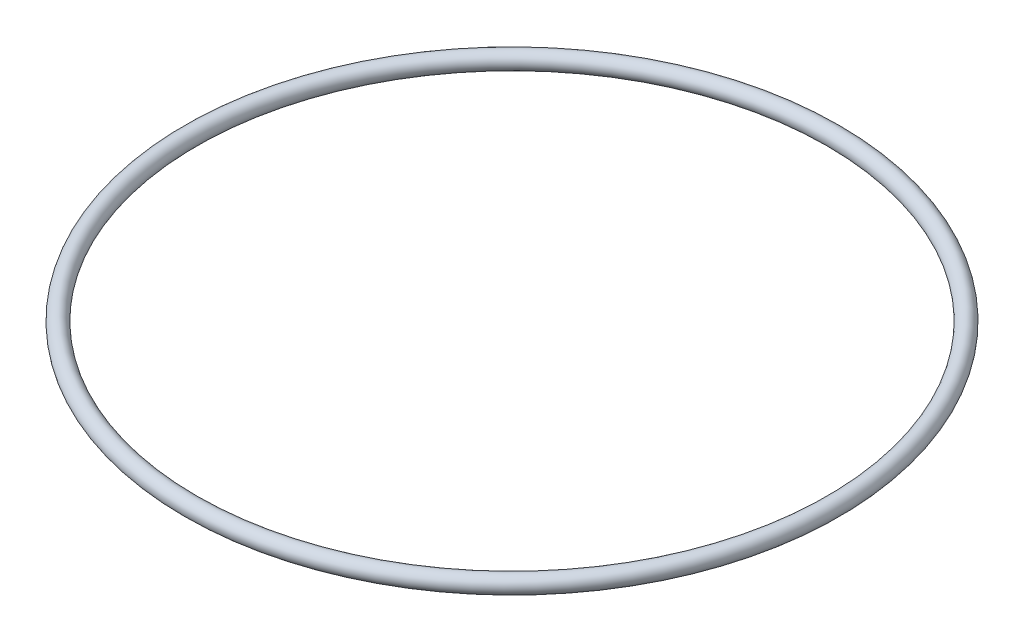
ISO-10303-21;
HEADER;
FILE_DESCRIPTION(('STEP AP214'),'2;1');
FILE_NAME('part.step','',(''),(''),'','','');
FILE_SCHEMA(('AUTOMOTIVE_DESIGN { 1 0 10303 214 1 1 1 1 }'));
ENDSEC;
DATA;
#1=APPLICATION_CONTEXT('core data for automotive mechanical design processes');
#2=APPLICATION_PROTOCOL_DEFINITION('international standard','automotive_design',2000,#1);
#3=PRODUCT_CONTEXT('',#1,'mechanical');
#4=PRODUCT('Part','Part','',(#3));
#5=PRODUCT_RELATED_PRODUCT_CATEGORY('part','',(#4));
#6=PRODUCT_DEFINITION_FORMATION('','',#4);
#7=PRODUCT_DEFINITION_CONTEXT('part definition',#1,'design');
#8=PRODUCT_DEFINITION('design','',#6,#7);
#9=PRODUCT_DEFINITION_SHAPE('','',#8);
#10=(LENGTH_UNIT() NAMED_UNIT(*) SI_UNIT(.MILLI.,.METRE.));
#11=(NAMED_UNIT(*) PLANE_ANGLE_UNIT() SI_UNIT($,.RADIAN.));
#12=(NAMED_UNIT(*) SI_UNIT($,.STERADIAN.) SOLID_ANGLE_UNIT());
#13=UNCERTAINTY_MEASURE_WITH_UNIT(LENGTH_MEASURE(1.E-05),#10,'distance_accuracy_value','');
#14=(GEOMETRIC_REPRESENTATION_CONTEXT(3) GLOBAL_UNCERTAINTY_ASSIGNED_CONTEXT((#13)) GLOBAL_UNIT_ASSIGNED_CONTEXT((#10,
#11,#12)) REPRESENTATION_CONTEXT('',''));
#15=CARTESIAN_POINT('',(0.,0.,0.));
#16=DIRECTION('',(0.,0.,1.));
#17=DIRECTION('',(1.,0.,0.));
#18=AXIS2_PLACEMENT_3D('',#15,#16,#17);
#19=CARTESIAN_POINT('',(0.,0.,0.));
#20=DIRECTION('',(0.,-1.,0.));
#21=DIRECTION('',(0.,0.,-1.));
#22=AXIS2_PLACEMENT_3D('',#19,#20,#21);
#23=TOROIDAL_SURFACE('',#22,38.,0.999999999999998);
#24=CARTESIAN_POINT('',(0.,0.,-39.));
#25=VERTEX_POINT('',#24);
#26=VERTEX_LOOP('',#25);
#27=FACE_BOUND('',#26,.T.);
#28=ADVANCED_FACE('F31',(#27),#23,.T.);
#29=CLOSED_SHELL('',(#28));
#30=MANIFOLD_SOLID_BREP('B2',#29);
#31=ADVANCED_BREP_SHAPE_REPRESENTATION('',(#18,#30),#14);
#32=SHAPE_DEFINITION_REPRESENTATION(#9,#31);
ENDSEC;
END-ISO-10303-21;
